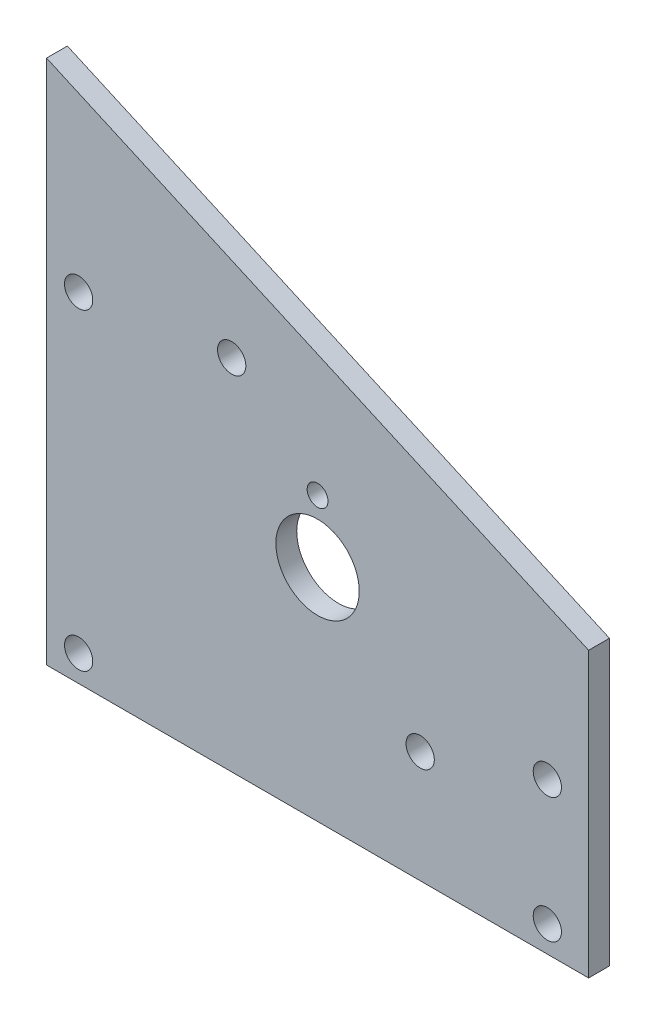
ISO-10303-21;
HEADER;
FILE_DESCRIPTION(('STEP AP214'),'2;1');
FILE_NAME('part.step','',(''),(''),'','','');
FILE_SCHEMA(('AUTOMOTIVE_DESIGN { 1 0 10303 214 1 1 1 1 }'));
ENDSEC;
DATA;
#1=APPLICATION_CONTEXT('core data for automotive mechanical design processes');
#2=APPLICATION_PROTOCOL_DEFINITION('international standard','automotive_design',2000,#1);
#3=PRODUCT_CONTEXT('',#1,'mechanical');
#4=PRODUCT('Part','Part','',(#3));
#5=PRODUCT_RELATED_PRODUCT_CATEGORY('part','',(#4));
#6=PRODUCT_DEFINITION_FORMATION('','',#4);
#7=PRODUCT_DEFINITION_CONTEXT('part definition',#1,'design');
#8=PRODUCT_DEFINITION('design','',#6,#7);
#9=PRODUCT_DEFINITION_SHAPE('','',#8);
#10=(LENGTH_UNIT() NAMED_UNIT(*) SI_UNIT(.MILLI.,.METRE.));
#11=(NAMED_UNIT(*) PLANE_ANGLE_UNIT() SI_UNIT($,.RADIAN.));
#12=(NAMED_UNIT(*) SI_UNIT($,.STERADIAN.) SOLID_ANGLE_UNIT());
#13=UNCERTAINTY_MEASURE_WITH_UNIT(LENGTH_MEASURE(1.E-05),#10,'distance_accuracy_value','');
#14=(GEOMETRIC_REPRESENTATION_CONTEXT(3) GLOBAL_UNCERTAINTY_ASSIGNED_CONTEXT((#13)) GLOBAL_UNIT_ASSIGNED_CONTEXT((#10,
#11,#12)) REPRESENTATION_CONTEXT('',''));
#15=CARTESIAN_POINT('',(0.,0.,0.));
#16=DIRECTION('',(0.,0.,1.));
#17=DIRECTION('',(1.,0.,0.));
#18=AXIS2_PLACEMENT_3D('',#15,#16,#17);
#19=CARTESIAN_POINT('',(0.,95.25,-3.175));
#20=DIRECTION('',(-1.,0.,0.));
#21=DIRECTION('',(0.,-1.,0.));
#22=AXIS2_PLACEMENT_3D('',#19,#20,#21);
#23=PLANE('',#22);
#24=DIRECTION('',(0.,0.,1.));
#25=VECTOR('',#24,1.);
#26=CARTESIAN_POINT('',(0.,13.462,-3.175));
#27=LINE('',#26,#25);
#28=CARTESIAN_POINT('',(0.,13.462,-3.175));
#29=VERTEX_POINT('',#28);
#30=CARTESIAN_POINT('',(0.,13.462,0.));
#31=VERTEX_POINT('',#30);
#32=EDGE_CURVE('E92',#29,#31,#27,.T.);
#33=ORIENTED_EDGE('',*,*,#32,.T.);
#34=DIRECTION('',(0.,-1.,0.));
#35=VECTOR('',#34,1.);
#36=CARTESIAN_POINT('',(0.,95.25,0.));
#37=LINE('',#36,#35);
#38=CARTESIAN_POINT('',(0.,93.5116670188786,0.));
#39=VERTEX_POINT('',#38);
#40=EDGE_CURVE('E44',#39,#31,#37,.T.);
#41=ORIENTED_EDGE('',*,*,#40,.F.);
#42=DIRECTION('',(0.,0.,1.));
#43=VECTOR('',#42,1.);
#44=CARTESIAN_POINT('',(0.,93.5116670188786,-3.175));
#45=LINE('',#44,#43);
#46=CARTESIAN_POINT('',(0.,93.5116670188786,-3.175));
#47=VERTEX_POINT('',#46);
#48=EDGE_CURVE('E68',#47,#39,#45,.T.);
#49=ORIENTED_EDGE('',*,*,#48,.F.);
#50=DIRECTION('',(0.,-1.,0.));
#51=VECTOR('',#50,1.);
#52=CARTESIAN_POINT('',(0.,95.25,-3.175));
#53=LINE('',#52,#51);
#54=EDGE_CURVE('E11',#47,#29,#53,.T.);
#55=ORIENTED_EDGE('',*,*,#54,.T.);
#56=EDGE_LOOP('',(#33,#41,#49,#55));
#57=FACE_BOUND('',#56,.T.);
#58=ADVANCED_FACE('F40',(#57),#23,.T.);
#59=CARTESIAN_POINT('',(82.55,0.,-3.175));
#60=DIRECTION('',(1.,0.,0.));
#61=DIRECTION('',(0.,0.,-1.));
#62=AXIS2_PLACEMENT_3D('',#59,#60,#61);
#63=PLANE('',#62);
#64=DIRECTION('',(0.,0.,1.));
#65=VECTOR('',#64,1.);
#66=CARTESIAN_POINT('',(82.55,13.462,-3.175));
#67=LINE('',#66,#65);
#68=CARTESIAN_POINT('',(82.55,13.462,-3.175));
#69=VERTEX_POINT('',#68);
#70=CARTESIAN_POINT('',(82.55,13.462,0.));
#71=VERTEX_POINT('',#70);
#72=EDGE_CURVE('E89',#69,#71,#67,.T.);
#73=ORIENTED_EDGE('',*,*,#72,.F.);
#74=DIRECTION('',(0.,1.,0.));
#75=VECTOR('',#74,1.);
#76=CARTESIAN_POINT('',(82.55,0.,-3.175));
#77=LINE('',#76,#75);
#78=CARTESIAN_POINT('',(82.55,56.6816670188786,-3.175));
#79=VERTEX_POINT('',#78);
#80=EDGE_CURVE('E49',#69,#79,#77,.T.);
#81=ORIENTED_EDGE('',*,*,#80,.T.);
#82=DIRECTION('',(0.,0.,1.));
#83=VECTOR('',#82,1.);
#84=CARTESIAN_POINT('',(82.55,56.6816670188786,-3.175));
#85=LINE('',#84,#83);
#86=CARTESIAN_POINT('',(82.55,56.6816670188786,0.));
#87=VERTEX_POINT('',#86);
#88=EDGE_CURVE('E130',#79,#87,#85,.T.);
#89=ORIENTED_EDGE('',*,*,#88,.T.);
#90=DIRECTION('',(0.,1.,0.));
#91=VECTOR('',#90,1.);
#92=CARTESIAN_POINT('',(82.55,0.,0.));
#93=LINE('',#92,#91);
#94=EDGE_CURVE('E102',#71,#87,#93,.T.);
#95=ORIENTED_EDGE('',*,*,#94,.F.);
#96=EDGE_LOOP('',(#73,#81,#89,#95));
#97=FACE_BOUND('',#96,.T.);
#98=ADVANCED_FACE('F99',(#97),#63,.T.);
#99=CARTESIAN_POINT('',(49.022,13.462,-3.175));
#100=DIRECTION('',(0.,-1.,0.));
#101=DIRECTION('',(0.,0.,-1.));
#102=AXIS2_PLACEMENT_3D('',#99,#100,#101);
#103=PLANE('',#102);
#104=DIRECTION('',(1.,0.,0.));
#105=VECTOR('',#104,1.);
#106=CARTESIAN_POINT('',(49.022,13.462,0.));
#107=LINE('',#106,#105);
#108=EDGE_CURVE('E60',#31,#71,#107,.T.);
#109=ORIENTED_EDGE('',*,*,#108,.F.);
#110=ORIENTED_EDGE('',*,*,#32,.F.);
#111=DIRECTION('',(1.,0.,0.));
#112=VECTOR('',#111,1.);
#113=CARTESIAN_POINT('',(49.022,13.462,-3.175));
#114=LINE('',#113,#112);
#115=EDGE_CURVE('E87',#29,#69,#114,.T.);
#116=ORIENTED_EDGE('',*,*,#115,.T.);
#117=ORIENTED_EDGE('',*,*,#72,.T.);
#118=EDGE_LOOP('',(#109,#110,#116,#117));
#119=FACE_BOUND('',#118,.T.);
#120=ADVANCED_FACE('F42',(#119),#103,.T.);
#121=CARTESIAN_POINT('',(49.022,8.382,-3.175));
#122=DIRECTION('',(0.,0.,1.));
#123=DIRECTION('',(1.,0.,0.));
#124=AXIS2_PLACEMENT_3D('',#121,#122,#123);
#125=PLANE('',#124);
#126=CARTESIAN_POINT('',(41.275,56.4888730126892,-3.175));
#127=DIRECTION('',(0.,0.,1.));
#128=DIRECTION('',(1.,0.,0.));
#129=AXIS2_PLACEMENT_3D('',#126,#127,#128);
#130=CIRCLE('',#129,1.5875);
#131=CARTESIAN_POINT('',(42.8625,56.4888730126892,-3.175));
#132=VERTEX_POINT('',#131);
#133=EDGE_CURVE('E136',#132,#132,#130,.T.);
#134=ORIENTED_EDGE('',*,*,#133,.T.);
#135=EDGE_LOOP('',(#134));
#136=FACE_BOUND('',#135,.T.);
#137=CARTESIAN_POINT('',(41.275,46.99,-3.175));
#138=DIRECTION('',(0.,0.,-1.));
#139=DIRECTION('',(-1.,0.,0.));
#140=AXIS2_PLACEMENT_3D('',#137,#138,#139);
#141=CIRCLE('',#140,6.35);
#142=CARTESIAN_POINT('',(34.925,46.99,-3.175));
#143=VERTEX_POINT('',#142);
#144=EDGE_CURVE('E139',#143,#143,#141,.T.);
#145=ORIENTED_EDGE('',*,*,#144,.F.);
#146=EDGE_LOOP('',(#145));
#147=FACE_BOUND('',#146,.T.);
#148=CARTESIAN_POINT('',(4.8895,17.4625,-3.175));
#149=DIRECTION('',(0.,0.,-1.));
#150=DIRECTION('',(-1.,0.,0.));
#151=AXIS2_PLACEMENT_3D('',#148,#149,#150);
#152=CIRCLE('',#151,2.15265);
#153=CARTESIAN_POINT('',(2.73685,17.4625,-3.175));
#154=VERTEX_POINT('',#153);
#155=EDGE_CURVE('E145',#154,#154,#152,.T.);
#156=ORIENTED_EDGE('',*,*,#155,.F.);
#157=EDGE_LOOP('',(#156));
#158=FACE_BOUND('',#157,.T.);
#159=CARTESIAN_POINT('',(4.8895,65.0875,-3.175));
#160=DIRECTION('',(0.,0.,-1.));
#161=DIRECTION('',(-1.,0.,0.));
#162=AXIS2_PLACEMENT_3D('',#159,#160,#161);
#163=CIRCLE('',#162,2.15265);
#164=CARTESIAN_POINT('',(2.73685,65.0875,-3.175));
#165=VERTEX_POINT('',#164);
#166=EDGE_CURVE('E151',#165,#165,#163,.T.);
#167=ORIENTED_EDGE('',*,*,#166,.F.);
#168=EDGE_LOOP('',(#167));
#169=FACE_BOUND('',#168,.T.);
#170=CARTESIAN_POINT('',(76.2635,36.5125,-3.175));
#171=DIRECTION('',(0.,0.,-1.));
#172=DIRECTION('',(-1.,0.,0.));
#173=AXIS2_PLACEMENT_3D('',#170,#171,#172);
#174=CIRCLE('',#173,2.15264999999999);
#175=CARTESIAN_POINT('',(74.11085,36.5125,-3.175));
#176=VERTEX_POINT('',#175);
#177=EDGE_CURVE('E157',#176,#176,#174,.T.);
#178=ORIENTED_EDGE('',*,*,#177,.F.);
#179=EDGE_LOOP('',(#178));
#180=FACE_BOUND('',#179,.T.);
#181=CARTESIAN_POINT('',(76.2635,17.4625,-3.175));
#182=DIRECTION('',(0.,0.,-1.));
#183=DIRECTION('',(-1.,0.,0.));
#184=AXIS2_PLACEMENT_3D('',#181,#182,#183);
#185=CIRCLE('',#184,2.15264999999999);
#186=CARTESIAN_POINT('',(74.11085,17.4625,-3.175));
#187=VERTEX_POINT('',#186);
#188=EDGE_CURVE('E163',#187,#187,#185,.T.);
#189=ORIENTED_EDGE('',*,*,#188,.F.);
#190=EDGE_LOOP('',(#189));
#191=FACE_BOUND('',#190,.T.);
#192=CARTESIAN_POINT('',(28.194,68.072,-3.175));
#193=DIRECTION('',(0.,0.,-1.));
#194=DIRECTION('',(-1.,0.,0.));
#195=AXIS2_PLACEMENT_3D('',#192,#193,#194);
#196=CIRCLE('',#195,2.15265);
#197=CARTESIAN_POINT('',(26.04135,68.072,-3.175));
#198=VERTEX_POINT('',#197);
#199=EDGE_CURVE('E171',#198,#198,#196,.T.);
#200=ORIENTED_EDGE('',*,*,#199,.F.);
#201=EDGE_LOOP('',(#200));
#202=FACE_BOUND('',#201,.T.);
#203=CARTESIAN_POINT('',(56.896,30.48,-3.175));
#204=DIRECTION('',(0.,0.,-1.));
#205=DIRECTION('',(-1.,0.,0.));
#206=AXIS2_PLACEMENT_3D('',#203,#204,#205);
#207=CIRCLE('',#206,2.15265);
#208=CARTESIAN_POINT('',(54.74335,30.48,-3.175));
#209=VERTEX_POINT('',#208);
#210=EDGE_CURVE('E177',#209,#209,#207,.T.);
#211=ORIENTED_EDGE('',*,*,#210,.F.);
#212=EDGE_LOOP('',(#211));
#213=FACE_BOUND('',#212,.T.);
#214=ORIENTED_EDGE('',*,*,#80,.F.);
#215=ORIENTED_EDGE('',*,*,#115,.F.);
#216=ORIENTED_EDGE('',*,*,#54,.F.);
#217=DIRECTION('',(0.913231249271872,-0.407441634290528,0.));
#218=VECTOR('',#217,1.);
#219=CARTESIAN_POINT('',(82.55,56.6816670188786,-3.175));
#220=LINE('',#219,#218);
#221=EDGE_CURVE('E107',#47,#79,#220,.T.);
#222=ORIENTED_EDGE('',*,*,#221,.T.);
#223=EDGE_LOOP('',(#214,#215,#216,#222));
#224=FACE_BOUND('',#223,.T.);
#225=ADVANCED_FACE('F106',(#136,#147,#158,#169,#180,#191,#202,#213,#224),#125,.F.);
#226=CARTESIAN_POINT('',(49.022,8.382,0.));
#227=DIRECTION('',(0.,0.,1.));
#228=DIRECTION('',(1.,0.,0.));
#229=AXIS2_PLACEMENT_3D('',#226,#227,#228);
#230=PLANE('',#229);
#231=ORIENTED_EDGE('',*,*,#108,.T.);
#232=ORIENTED_EDGE('',*,*,#94,.T.);
#233=DIRECTION('',(0.913231249271872,-0.407441634290528,0.));
#234=VECTOR('',#233,1.);
#235=CARTESIAN_POINT('',(82.55,56.6816670188786,0.));
#236=LINE('',#235,#234);
#237=EDGE_CURVE('E122',#39,#87,#236,.T.);
#238=ORIENTED_EDGE('',*,*,#237,.F.);
#239=ORIENTED_EDGE('',*,*,#40,.T.);
#240=EDGE_LOOP('',(#231,#232,#238,#239));
#241=FACE_BOUND('',#240,.T.);
#242=CARTESIAN_POINT('',(41.275,56.4888730126892,0.));
#243=DIRECTION('',(0.,0.,1.));
#244=DIRECTION('',(1.,0.,0.));
#245=AXIS2_PLACEMENT_3D('',#242,#243,#244);
#246=CIRCLE('',#245,1.5875);
#247=CARTESIAN_POINT('',(42.8625,56.4888730126892,0.));
#248=VERTEX_POINT('',#247);
#249=EDGE_CURVE('E132',#248,#248,#246,.T.);
#250=ORIENTED_EDGE('',*,*,#249,.F.);
#251=EDGE_LOOP('',(#250));
#252=FACE_BOUND('',#251,.T.);
#253=CARTESIAN_POINT('',(41.275,46.99,0.));
#254=DIRECTION('',(0.,0.,-1.));
#255=DIRECTION('',(-1.,0.,0.));
#256=AXIS2_PLACEMENT_3D('',#253,#254,#255);
#257=CIRCLE('',#256,6.35);
#258=CARTESIAN_POINT('',(34.925,46.99,0.));
#259=VERTEX_POINT('',#258);
#260=EDGE_CURVE('E142',#259,#259,#257,.T.);
#261=ORIENTED_EDGE('',*,*,#260,.T.);
#262=EDGE_LOOP('',(#261));
#263=FACE_BOUND('',#262,.T.);
#264=CARTESIAN_POINT('',(4.8895,17.4625,0.));
#265=DIRECTION('',(0.,0.,-1.));
#266=DIRECTION('',(-1.,0.,0.));
#267=AXIS2_PLACEMENT_3D('',#264,#265,#266);
#268=CIRCLE('',#267,2.15265);
#269=CARTESIAN_POINT('',(2.73685,17.4625,0.));
#270=VERTEX_POINT('',#269);
#271=EDGE_CURVE('E148',#270,#270,#268,.T.);
#272=ORIENTED_EDGE('',*,*,#271,.T.);
#273=EDGE_LOOP('',(#272));
#274=FACE_BOUND('',#273,.T.);
#275=CARTESIAN_POINT('',(4.8895,65.0875,0.));
#276=DIRECTION('',(0.,0.,-1.));
#277=DIRECTION('',(-1.,0.,0.));
#278=AXIS2_PLACEMENT_3D('',#275,#276,#277);
#279=CIRCLE('',#278,2.15265);
#280=CARTESIAN_POINT('',(2.73685,65.0875,0.));
#281=VERTEX_POINT('',#280);
#282=EDGE_CURVE('E154',#281,#281,#279,.T.);
#283=ORIENTED_EDGE('',*,*,#282,.T.);
#284=EDGE_LOOP('',(#283));
#285=FACE_BOUND('',#284,.T.);
#286=CARTESIAN_POINT('',(76.2635,36.5125,0.));
#287=DIRECTION('',(0.,0.,-1.));
#288=DIRECTION('',(-1.,0.,0.));
#289=AXIS2_PLACEMENT_3D('',#286,#287,#288);
#290=CIRCLE('',#289,2.15264999999999);
#291=CARTESIAN_POINT('',(74.11085,36.5125,0.));
#292=VERTEX_POINT('',#291);
#293=EDGE_CURVE('E160',#292,#292,#290,.T.);
#294=ORIENTED_EDGE('',*,*,#293,.T.);
#295=EDGE_LOOP('',(#294));
#296=FACE_BOUND('',#295,.T.);
#297=CARTESIAN_POINT('',(76.2635,17.4625,0.));
#298=DIRECTION('',(0.,0.,-1.));
#299=DIRECTION('',(-1.,0.,0.));
#300=AXIS2_PLACEMENT_3D('',#297,#298,#299);
#301=CIRCLE('',#300,2.15264999999999);
#302=CARTESIAN_POINT('',(74.11085,17.4625,0.));
#303=VERTEX_POINT('',#302);
#304=EDGE_CURVE('E167',#303,#303,#301,.T.);
#305=ORIENTED_EDGE('',*,*,#304,.T.);
#306=EDGE_LOOP('',(#305));
#307=FACE_BOUND('',#306,.T.);
#308=CARTESIAN_POINT('',(28.194,68.072,0.));
#309=DIRECTION('',(0.,0.,-1.));
#310=DIRECTION('',(-1.,0.,0.));
#311=AXIS2_PLACEMENT_3D('',#308,#309,#310);
#312=CIRCLE('',#311,2.15265);
#313=CARTESIAN_POINT('',(26.04135,68.072,0.));
#314=VERTEX_POINT('',#313);
#315=EDGE_CURVE('E174',#314,#314,#312,.T.);
#316=ORIENTED_EDGE('',*,*,#315,.T.);
#317=EDGE_LOOP('',(#316));
#318=FACE_BOUND('',#317,.T.);
#319=CARTESIAN_POINT('',(56.896,30.48,0.));
#320=DIRECTION('',(0.,0.,-1.));
#321=DIRECTION('',(-1.,0.,0.));
#322=AXIS2_PLACEMENT_3D('',#319,#320,#321);
#323=CIRCLE('',#322,2.15265);
#324=CARTESIAN_POINT('',(54.74335,30.48,0.));
#325=VERTEX_POINT('',#324);
#326=EDGE_CURVE('E115',#325,#325,#323,.T.);
#327=ORIENTED_EDGE('',*,*,#326,.T.);
#328=EDGE_LOOP('',(#327));
#329=FACE_BOUND('',#328,.T.);
#330=ADVANCED_FACE('F120',(#241,#252,#263,#274,#285,#296,#307,#318,#329),#230,.T.);
#331=CARTESIAN_POINT('',(56.896,30.48,-3.175));
#332=DIRECTION('',(0.,0.,-1.));
#333=DIRECTION('',(-1.,0.,0.));
#334=AXIS2_PLACEMENT_3D('',#331,#332,#333);
#335=CYLINDRICAL_SURFACE('',#334,2.15265);
#336=ORIENTED_EDGE('',*,*,#326,.F.);
#337=EDGE_LOOP('',(#336));
#338=FACE_BOUND('',#337,.T.);
#339=ORIENTED_EDGE('',*,*,#210,.T.);
#340=EDGE_LOOP('',(#339));
#341=FACE_BOUND('',#340,.T.);
#342=ADVANCED_FACE('F184',(#338,#341),#335,.F.);
#343=CARTESIAN_POINT('',(28.194,68.072,-3.175));
#344=DIRECTION('',(0.,0.,-1.));
#345=DIRECTION('',(-1.,0.,0.));
#346=AXIS2_PLACEMENT_3D('',#343,#344,#345);
#347=CYLINDRICAL_SURFACE('',#346,2.15265);
#348=ORIENTED_EDGE('',*,*,#315,.F.);
#349=EDGE_LOOP('',(#348));
#350=FACE_BOUND('',#349,.T.);
#351=ORIENTED_EDGE('',*,*,#199,.T.);
#352=EDGE_LOOP('',(#351));
#353=FACE_BOUND('',#352,.T.);
#354=ADVANCED_FACE('F187',(#350,#353),#347,.F.);
#355=CARTESIAN_POINT('',(76.2635,17.4625,-3.175));
#356=DIRECTION('',(0.,0.,-1.));
#357=DIRECTION('',(-1.,0.,0.));
#358=AXIS2_PLACEMENT_3D('',#355,#356,#357);
#359=CYLINDRICAL_SURFACE('',#358,2.15264999999999);
#360=ORIENTED_EDGE('',*,*,#304,.F.);
#361=EDGE_LOOP('',(#360));
#362=FACE_BOUND('',#361,.T.);
#363=ORIENTED_EDGE('',*,*,#188,.T.);
#364=EDGE_LOOP('',(#363));
#365=FACE_BOUND('',#364,.T.);
#366=ADVANCED_FACE('F235',(#362,#365),#359,.F.);
#367=CARTESIAN_POINT('',(76.2635,36.5125,-3.175));
#368=DIRECTION('',(0.,0.,-1.));
#369=DIRECTION('',(-1.,0.,0.));
#370=AXIS2_PLACEMENT_3D('',#367,#368,#369);
#371=CYLINDRICAL_SURFACE('',#370,2.15264999999999);
#372=ORIENTED_EDGE('',*,*,#293,.F.);
#373=EDGE_LOOP('',(#372));
#374=FACE_BOUND('',#373,.T.);
#375=ORIENTED_EDGE('',*,*,#177,.T.);
#376=EDGE_LOOP('',(#375));
#377=FACE_BOUND('',#376,.T.);
#378=ADVANCED_FACE('F243',(#374,#377),#371,.F.);
#379=CARTESIAN_POINT('',(4.8895,65.0875,-3.175));
#380=DIRECTION('',(0.,0.,-1.));
#381=DIRECTION('',(-1.,0.,0.));
#382=AXIS2_PLACEMENT_3D('',#379,#380,#381);
#383=CYLINDRICAL_SURFACE('',#382,2.15265);
#384=ORIENTED_EDGE('',*,*,#282,.F.);
#385=EDGE_LOOP('',(#384));
#386=FACE_BOUND('',#385,.T.);
#387=ORIENTED_EDGE('',*,*,#166,.T.);
#388=EDGE_LOOP('',(#387));
#389=FACE_BOUND('',#388,.T.);
#390=ADVANCED_FACE('F251',(#386,#389),#383,.F.);
#391=CARTESIAN_POINT('',(4.8895,17.4625,-3.175));
#392=DIRECTION('',(0.,0.,-1.));
#393=DIRECTION('',(-1.,0.,0.));
#394=AXIS2_PLACEMENT_3D('',#391,#392,#393);
#395=CYLINDRICAL_SURFACE('',#394,2.15265);
#396=ORIENTED_EDGE('',*,*,#271,.F.);
#397=EDGE_LOOP('',(#396));
#398=FACE_BOUND('',#397,.T.);
#399=ORIENTED_EDGE('',*,*,#155,.T.);
#400=EDGE_LOOP('',(#399));
#401=FACE_BOUND('',#400,.T.);
#402=ADVANCED_FACE('F259',(#398,#401),#395,.F.);
#403=CARTESIAN_POINT('',(41.275,46.99,-3.175));
#404=DIRECTION('',(0.,0.,-1.));
#405=DIRECTION('',(-1.,0.,0.));
#406=AXIS2_PLACEMENT_3D('',#403,#404,#405);
#407=CYLINDRICAL_SURFACE('',#406,6.35);
#408=ORIENTED_EDGE('',*,*,#260,.F.);
#409=EDGE_LOOP('',(#408));
#410=FACE_BOUND('',#409,.T.);
#411=ORIENTED_EDGE('',*,*,#144,.T.);
#412=EDGE_LOOP('',(#411));
#413=FACE_BOUND('',#412,.T.);
#414=ADVANCED_FACE('F267',(#410,#413),#407,.F.);
#415=CARTESIAN_POINT('',(41.275,56.4888730126892,0.));
#416=DIRECTION('',(0.,0.,1.));
#417=DIRECTION('',(1.,0.,0.));
#418=AXIS2_PLACEMENT_3D('',#415,#416,#417);
#419=CYLINDRICAL_SURFACE('',#418,1.5875);
#420=ORIENTED_EDGE('',*,*,#133,.F.);
#421=EDGE_LOOP('',(#420));
#422=FACE_BOUND('',#421,.T.);
#423=ORIENTED_EDGE('',*,*,#249,.T.);
#424=EDGE_LOOP('',(#423));
#425=FACE_BOUND('',#424,.T.);
#426=ADVANCED_FACE('F275',(#422,#425),#419,.F.);
#427=CARTESIAN_POINT('',(82.55,56.6816670188786,-3.175));
#428=DIRECTION('',(-0.407441634290528,-0.913231249271872,0.));
#429=DIRECTION('',(0.913231249271872,-0.407441634290528,0.));
#430=AXIS2_PLACEMENT_3D('',#427,#428,#429);
#431=PLANE('',#430);
#432=ORIENTED_EDGE('',*,*,#237,.T.);
#433=ORIENTED_EDGE('',*,*,#88,.F.);
#434=ORIENTED_EDGE('',*,*,#221,.F.);
#435=ORIENTED_EDGE('',*,*,#48,.T.);
#436=EDGE_LOOP('',(#432,#433,#434,#435));
#437=FACE_BOUND('',#436,.T.);
#438=ADVANCED_FACE('F283',(#437),#431,.F.);
#439=CLOSED_SHELL('',(#58,#98,#120,#225,#330,#342,#354,#366,#378,#390,#402,#414,#426,#438));
#440=MANIFOLD_SOLID_BREP('B2',#439);
#441=ADVANCED_BREP_SHAPE_REPRESENTATION('',(#18,#440),#14);
#442=SHAPE_DEFINITION_REPRESENTATION(#9,#441);
ENDSEC;
END-ISO-10303-21;
